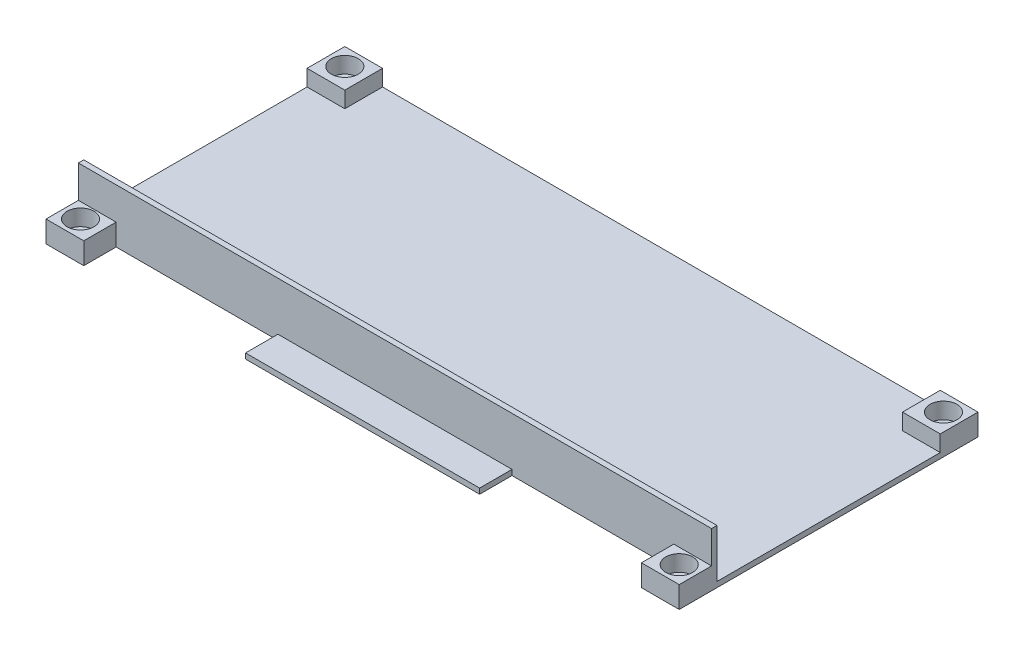
ISO-10303-21;
HEADER;
FILE_DESCRIPTION(('STEP AP214'),'2;1');
FILE_NAME('part.step','',(''),(''),'','','');
FILE_SCHEMA(('AUTOMOTIVE_DESIGN { 1 0 10303 214 1 1 1 1 }'));
ENDSEC;
DATA;
#1=APPLICATION_CONTEXT('core data for automotive mechanical design processes');
#2=APPLICATION_PROTOCOL_DEFINITION('international standard','automotive_design',2000,#1);
#3=PRODUCT_CONTEXT('',#1,'mechanical');
#4=PRODUCT('Part','Part','',(#3));
#5=PRODUCT_RELATED_PRODUCT_CATEGORY('part','',(#4));
#6=PRODUCT_DEFINITION_FORMATION('','',#4);
#7=PRODUCT_DEFINITION_CONTEXT('part definition',#1,'design');
#8=PRODUCT_DEFINITION('design','',#6,#7);
#9=PRODUCT_DEFINITION_SHAPE('','',#8);
#10=(LENGTH_UNIT() NAMED_UNIT(*) SI_UNIT(.MILLI.,.METRE.));
#11=(NAMED_UNIT(*) PLANE_ANGLE_UNIT() SI_UNIT($,.RADIAN.));
#12=(NAMED_UNIT(*) SI_UNIT($,.STERADIAN.) SOLID_ANGLE_UNIT());
#13=UNCERTAINTY_MEASURE_WITH_UNIT(LENGTH_MEASURE(1.E-05),#10,'distance_accuracy_value','');
#14=(GEOMETRIC_REPRESENTATION_CONTEXT(3) GLOBAL_UNCERTAINTY_ASSIGNED_CONTEXT((#13)) GLOBAL_UNIT_ASSIGNED_CONTEXT((#10,
#11,#12)) REPRESENTATION_CONTEXT('',''));
#15=CARTESIAN_POINT('',(0.,0.,0.));
#16=DIRECTION('',(0.,0.,1.));
#17=DIRECTION('',(1.,0.,0.));
#18=AXIS2_PLACEMENT_3D('',#15,#16,#17);
#19=CARTESIAN_POINT('',(0.,1.,0.));
#20=DIRECTION('',(0.,-1.,0.));
#21=DIRECTION('',(0.,0.,-1.));
#22=AXIS2_PLACEMENT_3D('',#19,#20,#21);
#23=PLANE('',#22);
#24=DIRECTION('',(0.,0.,1.));
#25=VECTOR('',#24,1.);
#26=CARTESIAN_POINT('',(-58.7,1.,27.7));
#27=LINE('',#26,#25);
#28=CARTESIAN_POINT('',(-58.7,1.,-20.7));
#29=VERTEX_POINT('',#28);
#30=CARTESIAN_POINT('',(-58.7,1.,20.7));
#31=VERTEX_POINT('',#30);
#32=EDGE_CURVE('E366',#29,#31,#27,.T.);
#33=ORIENTED_EDGE('',*,*,#32,.T.);
#34=DIRECTION('',(-1.,0.,0.));
#35=VECTOR('',#34,1.);
#36=CARTESIAN_POINT('',(58.7,1.,20.7));
#37=LINE('',#36,#35);
#38=CARTESIAN_POINT('',(58.7,1.,20.7));
#39=VERTEX_POINT('',#38);
#40=EDGE_CURVE('E306',#39,#31,#37,.T.);
#41=ORIENTED_EDGE('',*,*,#40,.F.);
#42=DIRECTION('',(0.,0.,-1.));
#43=VECTOR('',#42,1.);
#44=CARTESIAN_POINT('',(58.7,1.,27.7));
#45=LINE('',#44,#43);
#46=CARTESIAN_POINT('',(58.7,1.,-20.7));
#47=VERTEX_POINT('',#46);
#48=EDGE_CURVE('E192',#39,#47,#45,.T.);
#49=ORIENTED_EDGE('',*,*,#48,.T.);
#50=DIRECTION('',(1.,0.,0.));
#51=VECTOR('',#50,1.);
#52=CARTESIAN_POINT('',(58.7,1.,-20.7));
#53=LINE('',#52,#51);
#54=CARTESIAN_POINT('',(51.7,1.,-20.7));
#55=VERTEX_POINT('',#54);
#56=EDGE_CURVE('E318',#55,#47,#53,.T.);
#57=ORIENTED_EDGE('',*,*,#56,.F.);
#58=DIRECTION('',(0.,0.,1.));
#59=VECTOR('',#58,1.);
#60=CARTESIAN_POINT('',(51.7,1.,-27.7));
#61=LINE('',#60,#59);
#62=CARTESIAN_POINT('',(51.7,1.,-27.7));
#63=VERTEX_POINT('',#62);
#64=EDGE_CURVE('E194',#63,#55,#61,.T.);
#65=ORIENTED_EDGE('',*,*,#64,.F.);
#66=DIRECTION('',(-1.,0.,0.));
#67=VECTOR('',#66,1.);
#68=CARTESIAN_POINT('',(-58.7,1.,-27.7));
#69=LINE('',#68,#67);
#70=CARTESIAN_POINT('',(-51.7,1.,-27.7));
#71=VERTEX_POINT('',#70);
#72=EDGE_CURVE('E363',#63,#71,#69,.T.);
#73=ORIENTED_EDGE('',*,*,#72,.T.);
#74=DIRECTION('',(0.,0.,-1.));
#75=VECTOR('',#74,1.);
#76=CARTESIAN_POINT('',(-51.7,1.,-27.7));
#77=LINE('',#76,#75);
#78=CARTESIAN_POINT('',(-51.7,1.,-20.7));
#79=VERTEX_POINT('',#78);
#80=EDGE_CURVE('E341',#79,#71,#77,.T.);
#81=ORIENTED_EDGE('',*,*,#80,.F.);
#82=DIRECTION('',(1.,0.,0.));
#83=VECTOR('',#82,1.);
#84=CARTESIAN_POINT('',(-58.7,1.,-20.7));
#85=LINE('',#84,#83);
#86=EDGE_CURVE('E336',#29,#79,#85,.T.);
#87=ORIENTED_EDGE('',*,*,#86,.F.);
#88=EDGE_LOOP('',(#33,#41,#49,#57,#65,#73,#81,#87));
#89=FACE_BOUND('',#88,.T.);
#90=ADVANCED_FACE('F35',(#89),#23,.F.);
#91=DIRECTION('',(1.,0.,0.));
#92=VECTOR('',#91,1.);
#93=CARTESIAN_POINT('',(58.7,1.,21.7));
#94=LINE('',#93,#92);
#95=CARTESIAN_POINT('',(-21.7,1.,21.7));
#96=VERTEX_POINT('',#95);
#97=CARTESIAN_POINT('',(21.7,1.,21.7));
#98=VERTEX_POINT('',#97);
#99=EDGE_CURVE('E210',#96,#98,#94,.T.);
#100=ORIENTED_EDGE('',*,*,#99,.F.);
#101=DIRECTION('',(0.,0.,1.));
#102=VECTOR('',#101,1.);
#103=CARTESIAN_POINT('',(-21.7,1.,0.));
#104=LINE('',#103,#102);
#105=CARTESIAN_POINT('',(-21.7,1.,27.7));
#106=VERTEX_POINT('',#105);
#107=EDGE_CURVE('E260',#96,#106,#104,.T.);
#108=ORIENTED_EDGE('',*,*,#107,.T.);
#109=DIRECTION('',(1.,0.,0.));
#110=VECTOR('',#109,1.);
#111=CARTESIAN_POINT('',(-58.7,1.,27.7));
#112=LINE('',#111,#110);
#113=CARTESIAN_POINT('',(21.7,1.,27.7));
#114=VERTEX_POINT('',#113);
#115=EDGE_CURVE('E369',#106,#114,#112,.T.);
#116=ORIENTED_EDGE('',*,*,#115,.T.);
#117=DIRECTION('',(0.,0.,-1.));
#118=VECTOR('',#117,1.);
#119=CARTESIAN_POINT('',(21.7,1.,0.));
#120=LINE('',#119,#118);
#121=EDGE_CURVE('E281',#114,#98,#120,.T.);
#122=ORIENTED_EDGE('',*,*,#121,.T.);
#123=EDGE_LOOP('',(#100,#108,#116,#122));
#124=FACE_BOUND('',#123,.T.);
#125=ADVANCED_FACE('F423',(#124),#23,.F.);
#126=CARTESIAN_POINT('',(51.7,4.,27.7));
#127=DIRECTION('',(1.,0.,0.));
#128=DIRECTION('',(0.,0.,-1.));
#129=AXIS2_PLACEMENT_3D('',#126,#127,#128);
#130=PLANE('',#129);
#131=DIRECTION('',(0.,0.,1.));
#132=VECTOR('',#131,1.);
#133=CARTESIAN_POINT('',(51.7,4.,27.7));
#134=LINE('',#133,#132);
#135=CARTESIAN_POINT('',(51.7,4.,21.7));
#136=VERTEX_POINT('',#135);
#137=CARTESIAN_POINT('',(51.7,4.,27.7));
#138=VERTEX_POINT('',#137);
#139=EDGE_CURVE('E310',#136,#138,#134,.T.);
#140=ORIENTED_EDGE('',*,*,#139,.F.);
#141=DIRECTION('',(0.,-1.,0.));
#142=VECTOR('',#141,1.);
#143=CARTESIAN_POINT('',(51.7,4.,21.7));
#144=LINE('',#143,#142);
#145=CARTESIAN_POINT('',(51.7,0.,21.7));
#146=VERTEX_POINT('',#145);
#147=EDGE_CURVE('E50',#136,#146,#144,.T.);
#148=ORIENTED_EDGE('',*,*,#147,.T.);
#149=DIRECTION('',(0.,0.,1.));
#150=VECTOR('',#149,1.);
#151=CARTESIAN_POINT('',(51.7,0.,27.7));
#152=LINE('',#151,#150);
#153=CARTESIAN_POINT('',(51.7,0.,27.7));
#154=VERTEX_POINT('',#153);
#155=EDGE_CURVE('E249',#146,#154,#152,.T.);
#156=ORIENTED_EDGE('',*,*,#155,.T.);
#157=DIRECTION('',(0.,-1.,0.));
#158=VECTOR('',#157,1.);
#159=CARTESIAN_POINT('',(51.7,4.,27.7));
#160=LINE('',#159,#158);
#161=EDGE_CURVE('E195',#138,#154,#160,.T.);
#162=ORIENTED_EDGE('',*,*,#161,.F.);
#163=EDGE_LOOP('',(#140,#148,#156,#162));
#164=FACE_BOUND('',#163,.T.);
#165=ADVANCED_FACE('F429',(#164),#130,.F.);
#166=CARTESIAN_POINT('',(0.,4.,0.));
#167=DIRECTION('',(0.,-1.,0.));
#168=DIRECTION('',(0.,0.,-1.));
#169=AXIS2_PLACEMENT_3D('',#166,#167,#168);
#170=PLANE('',#169);
#171=CARTESIAN_POINT('',(55.5,4.,24.5));
#172=DIRECTION('',(0.,1.,0.));
#173=DIRECTION('',(0.,0.,1.));
#174=AXIS2_PLACEMENT_3D('',#171,#172,#173);
#175=CIRCLE('',#174,2.5);
#176=CARTESIAN_POINT('',(55.5,4.,27.));
#177=VERTEX_POINT('',#176);
#178=EDGE_CURVE('E233',#177,#177,#175,.T.);
#179=ORIENTED_EDGE('',*,*,#178,.F.);
#180=EDGE_LOOP('',(#179));
#181=FACE_BOUND('',#180,.T.);
#182=DIRECTION('',(1.,0.,0.));
#183=VECTOR('',#182,1.);
#184=CARTESIAN_POINT('',(0.,4.,21.7));
#185=LINE('',#184,#183);
#186=CARTESIAN_POINT('',(58.7,4.,21.7));
#187=VERTEX_POINT('',#186);
#188=EDGE_CURVE('E222',#136,#187,#185,.T.);
#189=ORIENTED_EDGE('',*,*,#188,.F.);
#190=ORIENTED_EDGE('',*,*,#139,.T.);
#191=DIRECTION('',(1.,0.,0.));
#192=VECTOR('',#191,1.);
#193=CARTESIAN_POINT('',(58.7,4.,27.7));
#194=LINE('',#193,#192);
#195=CARTESIAN_POINT('',(58.7,4.,27.7));
#196=VERTEX_POINT('',#195);
#197=EDGE_CURVE('E307',#138,#196,#194,.T.);
#198=ORIENTED_EDGE('',*,*,#197,.T.);
#199=DIRECTION('',(0.,0.,-1.));
#200=VECTOR('',#199,1.);
#201=CARTESIAN_POINT('',(58.7,4.,27.7));
#202=LINE('',#201,#200);
#203=EDGE_CURVE('E57',#196,#187,#202,.T.);
#204=ORIENTED_EDGE('',*,*,#203,.T.);
#205=EDGE_LOOP('',(#189,#190,#198,#204));
#206=FACE_BOUND('',#205,.T.);
#207=ADVANCED_FACE('F474',(#181,#206),#170,.F.);
#208=CARTESIAN_POINT('',(-51.7,4.,27.7));
#209=DIRECTION('',(-1.,0.,0.));
#210=DIRECTION('',(0.,0.,1.));
#211=AXIS2_PLACEMENT_3D('',#208,#209,#210);
#212=PLANE('',#211);
#213=DIRECTION('',(0.,-1.,0.));
#214=VECTOR('',#213,1.);
#215=CARTESIAN_POINT('',(-51.7,4.,21.7));
#216=LINE('',#215,#214);
#217=CARTESIAN_POINT('',(-51.7,4.,21.7));
#218=VERTEX_POINT('',#217);
#219=CARTESIAN_POINT('',(-51.7,0.,21.7));
#220=VERTEX_POINT('',#219);
#221=EDGE_CURVE('E273',#218,#220,#216,.T.);
#222=ORIENTED_EDGE('',*,*,#221,.F.);
#223=DIRECTION('',(0.,0.,-1.));
#224=VECTOR('',#223,1.);
#225=CARTESIAN_POINT('',(-51.7,4.,27.7));
#226=LINE('',#225,#224);
#227=CARTESIAN_POINT('',(-51.7,4.,27.7));
#228=VERTEX_POINT('',#227);
#229=EDGE_CURVE('E300',#228,#218,#226,.T.);
#230=ORIENTED_EDGE('',*,*,#229,.F.);
#231=DIRECTION('',(0.,-1.,0.));
#232=VECTOR('',#231,1.);
#233=CARTESIAN_POINT('',(-51.7,4.,27.7));
#234=LINE('',#233,#232);
#235=CARTESIAN_POINT('',(-51.7,0.,27.7));
#236=VERTEX_POINT('',#235);
#237=EDGE_CURVE('E304',#228,#236,#234,.T.);
#238=ORIENTED_EDGE('',*,*,#237,.T.);
#239=DIRECTION('',(0.,0.,-1.));
#240=VECTOR('',#239,1.);
#241=CARTESIAN_POINT('',(-51.7,0.,27.7));
#242=LINE('',#241,#240);
#243=EDGE_CURVE('E264',#236,#220,#242,.T.);
#244=ORIENTED_EDGE('',*,*,#243,.T.);
#245=EDGE_LOOP('',(#222,#230,#238,#244));
#246=FACE_BOUND('',#245,.T.);
#247=ADVANCED_FACE('F518',(#246),#212,.F.);
#248=CARTESIAN_POINT('',(0.,4.,0.));
#249=DIRECTION('',(0.,-1.,0.));
#250=DIRECTION('',(0.,0.,-1.));
#251=AXIS2_PLACEMENT_3D('',#248,#249,#250);
#252=PLANE('',#251);
#253=CARTESIAN_POINT('',(-55.5,4.,24.5));
#254=DIRECTION('',(0.,1.,0.));
#255=DIRECTION('',(0.,0.,1.));
#256=AXIS2_PLACEMENT_3D('',#253,#254,#255);
#257=CIRCLE('',#256,2.5);
#258=CARTESIAN_POINT('',(-55.5,4.,27.));
#259=VERTEX_POINT('',#258);
#260=EDGE_CURVE('E224',#259,#259,#257,.T.);
#261=ORIENTED_EDGE('',*,*,#260,.F.);
#262=EDGE_LOOP('',(#261));
#263=FACE_BOUND('',#262,.T.);
#264=DIRECTION('',(1.,0.,0.));
#265=VECTOR('',#264,1.);
#266=CARTESIAN_POINT('',(0.,4.,21.7));
#267=LINE('',#266,#265);
#268=CARTESIAN_POINT('',(-58.7,4.,21.7));
#269=VERTEX_POINT('',#268);
#270=EDGE_CURVE('E12',#269,#218,#267,.T.);
#271=ORIENTED_EDGE('',*,*,#270,.F.);
#272=DIRECTION('',(0.,0.,1.));
#273=VECTOR('',#272,1.);
#274=CARTESIAN_POINT('',(-58.7,4.,27.7));
#275=LINE('',#274,#273);
#276=CARTESIAN_POINT('',(-58.7,4.,27.7));
#277=VERTEX_POINT('',#276);
#278=EDGE_CURVE('E296',#269,#277,#275,.T.);
#279=ORIENTED_EDGE('',*,*,#278,.T.);
#280=DIRECTION('',(1.,0.,0.));
#281=VECTOR('',#280,1.);
#282=CARTESIAN_POINT('',(-58.7,4.,27.7));
#283=LINE('',#282,#281);
#284=EDGE_CURVE('E298',#277,#228,#283,.T.);
#285=ORIENTED_EDGE('',*,*,#284,.T.);
#286=ORIENTED_EDGE('',*,*,#229,.T.);
#287=EDGE_LOOP('',(#271,#279,#285,#286));
#288=FACE_BOUND('',#287,.T.);
#289=ADVANCED_FACE('F515',(#263,#288),#252,.F.);
#290=CARTESIAN_POINT('',(-58.7,1.,27.7));
#291=DIRECTION('',(0.,0.,-1.));
#292=DIRECTION('',(-1.,0.,0.));
#293=AXIS2_PLACEMENT_3D('',#290,#291,#292);
#294=PLANE('',#293);
#295=ORIENTED_EDGE('',*,*,#161,.T.);
#296=DIRECTION('',(1.,0.,0.));
#297=VECTOR('',#296,1.);
#298=CARTESIAN_POINT('',(-58.7,0.,27.7));
#299=LINE('',#298,#297);
#300=CARTESIAN_POINT('',(58.7,0.,27.7));
#301=VERTEX_POINT('',#300);
#302=EDGE_CURVE('E379',#154,#301,#299,.T.);
#303=ORIENTED_EDGE('',*,*,#302,.T.);
#304=DIRECTION('',(0.,-1.,0.));
#305=VECTOR('',#304,1.);
#306=CARTESIAN_POINT('',(58.7,1.,27.7));
#307=LINE('',#306,#305);
#308=EDGE_CURVE('E372',#196,#301,#307,.T.);
#309=ORIENTED_EDGE('',*,*,#308,.F.);
#310=ORIENTED_EDGE('',*,*,#197,.F.);
#311=EDGE_LOOP('',(#295,#303,#309,#310));
#312=FACE_BOUND('',#311,.T.);
#313=ADVANCED_FACE('F444',(#312),#294,.F.);
#314=CARTESIAN_POINT('',(-21.7,0.,27.7));
#315=VERTEX_POINT('',#314);
#316=CARTESIAN_POINT('',(21.7,0.,27.7));
#317=VERTEX_POINT('',#316);
#318=EDGE_CURVE('E382',#315,#317,#299,.T.);
#319=ORIENTED_EDGE('',*,*,#318,.T.);
#320=DIRECTION('',(0.,-1.,0.));
#321=VECTOR('',#320,1.);
#322=CARTESIAN_POINT('',(21.7,4.,27.7));
#323=LINE('',#322,#321);
#324=EDGE_CURVE('E258',#114,#317,#323,.T.);
#325=ORIENTED_EDGE('',*,*,#324,.F.);
#326=ORIENTED_EDGE('',*,*,#115,.F.);
#327=DIRECTION('',(0.,-1.,0.));
#328=VECTOR('',#327,1.);
#329=CARTESIAN_POINT('',(-21.7,4.,27.7));
#330=LINE('',#329,#328);
#331=EDGE_CURVE('E253',#106,#315,#330,.T.);
#332=ORIENTED_EDGE('',*,*,#331,.T.);
#333=EDGE_LOOP('',(#319,#325,#326,#332));
#334=FACE_BOUND('',#333,.T.);
#335=ADVANCED_FACE('F445',(#334),#294,.F.);
#336=CARTESIAN_POINT('',(58.7,1.,27.7));
#337=DIRECTION('',(-1.,0.,0.));
#338=DIRECTION('',(0.,0.,1.));
#339=AXIS2_PLACEMENT_3D('',#336,#337,#338);
#340=PLANE('',#339);
#341=DIRECTION('',(0.,-1.,0.));
#342=VECTOR('',#341,1.);
#343=CARTESIAN_POINT('',(58.7,4.,20.7));
#344=LINE('',#343,#342);
#345=CARTESIAN_POINT('',(58.7,10.,20.7));
#346=VERTEX_POINT('',#345);
#347=EDGE_CURVE('E186',#346,#39,#344,.T.);
#348=ORIENTED_EDGE('',*,*,#347,.F.);
#349=DIRECTION('',(0.,0.,-1.));
#350=VECTOR('',#349,1.);
#351=CARTESIAN_POINT('',(58.7,10.,21.7));
#352=LINE('',#351,#350);
#353=CARTESIAN_POINT('',(58.7,10.,21.7));
#354=VERTEX_POINT('',#353);
#355=EDGE_CURVE('E190',#354,#346,#352,.T.);
#356=ORIENTED_EDGE('',*,*,#355,.F.);
#357=DIRECTION('',(0.,-1.,0.));
#358=VECTOR('',#357,1.);
#359=CARTESIAN_POINT('',(58.7,10.,21.7));
#360=LINE('',#359,#358);
#361=EDGE_CURVE('E216',#354,#187,#360,.T.);
#362=ORIENTED_EDGE('',*,*,#361,.T.);
#363=ORIENTED_EDGE('',*,*,#203,.F.);
#364=ORIENTED_EDGE('',*,*,#308,.T.);
#365=DIRECTION('',(0.,0.,-1.));
#366=VECTOR('',#365,1.);
#367=CARTESIAN_POINT('',(58.7,0.,27.7));
#368=LINE('',#367,#366);
#369=CARTESIAN_POINT('',(58.7,0.,-27.7));
#370=VERTEX_POINT('',#369);
#371=EDGE_CURVE('E361',#301,#370,#368,.T.);
#372=ORIENTED_EDGE('',*,*,#371,.T.);
#373=DIRECTION('',(0.,-1.,0.));
#374=VECTOR('',#373,1.);
#375=CARTESIAN_POINT('',(58.7,1.,-27.7));
#376=LINE('',#375,#374);
#377=CARTESIAN_POINT('',(58.7,4.,-27.7));
#378=VERTEX_POINT('',#377);
#379=EDGE_CURVE('E43',#378,#370,#376,.T.);
#380=ORIENTED_EDGE('',*,*,#379,.F.);
#381=DIRECTION('',(0.,0.,-1.));
#382=VECTOR('',#381,1.);
#383=CARTESIAN_POINT('',(58.7,4.,-27.7));
#384=LINE('',#383,#382);
#385=CARTESIAN_POINT('',(58.7,4.,-20.7));
#386=VERTEX_POINT('',#385);
#387=EDGE_CURVE('E314',#386,#378,#384,.T.);
#388=ORIENTED_EDGE('',*,*,#387,.F.);
#389=DIRECTION('',(0.,-1.,0.));
#390=VECTOR('',#389,1.);
#391=CARTESIAN_POINT('',(58.7,4.,-20.7));
#392=LINE('',#391,#390);
#393=EDGE_CURVE('E324',#386,#47,#392,.T.);
#394=ORIENTED_EDGE('',*,*,#393,.T.);
#395=ORIENTED_EDGE('',*,*,#48,.F.);
#396=EDGE_LOOP('',(#348,#356,#362,#363,#364,#372,#380,#388,#394,#395));
#397=FACE_BOUND('',#396,.T.);
#398=ADVANCED_FACE('F37',(#397),#340,.F.);
#399=CARTESIAN_POINT('',(-58.7,1.,-27.7));
#400=DIRECTION('',(0.,0.,1.));
#401=DIRECTION('',(1.,0.,0.));
#402=AXIS2_PLACEMENT_3D('',#399,#400,#401);
#403=PLANE('',#402);
#404=DIRECTION('',(-1.,0.,0.));
#405=VECTOR('',#404,1.);
#406=CARTESIAN_POINT('',(-58.7,0.,-27.7));
#407=LINE('',#406,#405);
#408=CARTESIAN_POINT('',(-58.7,0.,-27.7));
#409=VERTEX_POINT('',#408);
#410=EDGE_CURVE('E375',#370,#409,#407,.T.);
#411=ORIENTED_EDGE('',*,*,#410,.T.);
#412=DIRECTION('',(0.,-1.,0.));
#413=VECTOR('',#412,1.);
#414=CARTESIAN_POINT('',(-58.7,1.,-27.7));
#415=LINE('',#414,#413);
#416=CARTESIAN_POINT('',(-58.7,4.,-27.7));
#417=VERTEX_POINT('',#416);
#418=EDGE_CURVE('E388',#417,#409,#415,.T.);
#419=ORIENTED_EDGE('',*,*,#418,.F.);
#420=DIRECTION('',(-1.,0.,0.));
#421=VECTOR('',#420,1.);
#422=CARTESIAN_POINT('',(-58.7,4.,-27.7));
#423=LINE('',#422,#421);
#424=CARTESIAN_POINT('',(-51.7,4.,-27.7));
#425=VERTEX_POINT('',#424);
#426=EDGE_CURVE('E345',#425,#417,#423,.T.);
#427=ORIENTED_EDGE('',*,*,#426,.F.);
#428=DIRECTION('',(0.,-1.,0.));
#429=VECTOR('',#428,1.);
#430=CARTESIAN_POINT('',(-51.7,4.,-27.7));
#431=LINE('',#430,#429);
#432=EDGE_CURVE('E348',#425,#71,#431,.T.);
#433=ORIENTED_EDGE('',*,*,#432,.T.);
#434=ORIENTED_EDGE('',*,*,#72,.F.);
#435=DIRECTION('',(0.,-1.,0.));
#436=VECTOR('',#435,1.);
#437=CARTESIAN_POINT('',(51.7,4.,-27.7));
#438=LINE('',#437,#436);
#439=CARTESIAN_POINT('',(51.7,4.,-27.7));
#440=VERTEX_POINT('',#439);
#441=EDGE_CURVE('E333',#440,#63,#438,.T.);
#442=ORIENTED_EDGE('',*,*,#441,.F.);
#443=DIRECTION('',(-1.,0.,0.));
#444=VECTOR('',#443,1.);
#445=CARTESIAN_POINT('',(58.7,4.,-27.7));
#446=LINE('',#445,#444);
#447=EDGE_CURVE('E317',#378,#440,#446,.T.);
#448=ORIENTED_EDGE('',*,*,#447,.F.);
#449=ORIENTED_EDGE('',*,*,#379,.T.);
#450=EDGE_LOOP('',(#411,#419,#427,#433,#434,#442,#448,#449));
#451=FACE_BOUND('',#450,.T.);
#452=ADVANCED_FACE('F447',(#451),#403,.F.);
#453=CARTESIAN_POINT('',(-58.7,1.,27.7));
#454=DIRECTION('',(1.,0.,0.));
#455=DIRECTION('',(0.,0.,-1.));
#456=AXIS2_PLACEMENT_3D('',#453,#454,#455);
#457=PLANE('',#456);
#458=ORIENTED_EDGE('',*,*,#278,.F.);
#459=DIRECTION('',(0.,-1.,0.));
#460=VECTOR('',#459,1.);
#461=CARTESIAN_POINT('',(-58.7,10.,21.7));
#462=LINE('',#461,#460);
#463=CARTESIAN_POINT('',(-58.7,10.,21.7));
#464=VERTEX_POINT('',#463);
#465=EDGE_CURVE('E219',#464,#269,#462,.T.);
#466=ORIENTED_EDGE('',*,*,#465,.F.);
#467=DIRECTION('',(0.,0.,1.));
#468=VECTOR('',#467,1.);
#469=CARTESIAN_POINT('',(-58.7,10.,21.7));
#470=LINE('',#469,#468);
#471=CARTESIAN_POINT('',(-58.7,10.,20.7));
#472=VERTEX_POINT('',#471);
#473=EDGE_CURVE('E204',#472,#464,#470,.T.);
#474=ORIENTED_EDGE('',*,*,#473,.F.);
#475=DIRECTION('',(0.,-1.,0.));
#476=VECTOR('',#475,1.);
#477=CARTESIAN_POINT('',(-58.7,4.,20.7));
#478=LINE('',#477,#476);
#479=EDGE_CURVE('E201',#472,#31,#478,.T.);
#480=ORIENTED_EDGE('',*,*,#479,.T.);
#481=ORIENTED_EDGE('',*,*,#32,.F.);
#482=DIRECTION('',(0.,-1.,0.));
#483=VECTOR('',#482,1.);
#484=CARTESIAN_POINT('',(-58.7,4.,-20.7));
#485=LINE('',#484,#483);
#486=CARTESIAN_POINT('',(-58.7,4.,-20.7));
#487=VERTEX_POINT('',#486);
#488=EDGE_CURVE('E358',#487,#29,#485,.T.);
#489=ORIENTED_EDGE('',*,*,#488,.F.);
#490=DIRECTION('',(0.,0.,1.));
#491=VECTOR('',#490,1.);
#492=CARTESIAN_POINT('',(-58.7,4.,-27.7));
#493=LINE('',#492,#491);
#494=EDGE_CURVE('E337',#417,#487,#493,.T.);
#495=ORIENTED_EDGE('',*,*,#494,.F.);
#496=ORIENTED_EDGE('',*,*,#418,.T.);
#497=DIRECTION('',(0.,0.,1.));
#498=VECTOR('',#497,1.);
#499=CARTESIAN_POINT('',(-58.7,0.,27.7));
#500=LINE('',#499,#498);
#501=CARTESIAN_POINT('',(-58.7,0.,27.7));
#502=VERTEX_POINT('',#501);
#503=EDGE_CURVE('E377',#409,#502,#500,.T.);
#504=ORIENTED_EDGE('',*,*,#503,.T.);
#505=DIRECTION('',(0.,-1.,0.));
#506=VECTOR('',#505,1.);
#507=CARTESIAN_POINT('',(-58.7,1.,27.7));
#508=LINE('',#507,#506);
#509=EDGE_CURVE('E385',#277,#502,#508,.T.);
#510=ORIENTED_EDGE('',*,*,#509,.F.);
#511=EDGE_LOOP('',(#458,#466,#474,#480,#481,#489,#495,#496,#504,#510));
#512=FACE_BOUND('',#511,.T.);
#513=ADVANCED_FACE('F442',(#512),#457,.F.);
#514=EDGE_CURVE('E364',#502,#236,#299,.T.);
#515=ORIENTED_EDGE('',*,*,#514,.T.);
#516=ORIENTED_EDGE('',*,*,#237,.F.);
#517=ORIENTED_EDGE('',*,*,#284,.F.);
#518=ORIENTED_EDGE('',*,*,#509,.T.);
#519=EDGE_LOOP('',(#515,#516,#517,#518));
#520=FACE_BOUND('',#519,.T.);
#521=ADVANCED_FACE('F438',(#520),#294,.F.);
#522=CARTESIAN_POINT('',(0.,0.,0.));
#523=DIRECTION('',(0.,-1.,0.));
#524=DIRECTION('',(0.,0.,-1.));
#525=AXIS2_PLACEMENT_3D('',#522,#523,#524);
#526=PLANE('',#525);
#527=ORIENTED_EDGE('',*,*,#155,.F.);
#528=DIRECTION('',(1.,0.,0.));
#529=VECTOR('',#528,1.);
#530=CARTESIAN_POINT('',(51.7,0.,21.7));
#531=LINE('',#530,#529);
#532=CARTESIAN_POINT('',(21.7,0.,21.7));
#533=VERTEX_POINT('',#532);
#534=EDGE_CURVE('E256',#533,#146,#531,.T.);
#535=ORIENTED_EDGE('',*,*,#534,.F.);
#536=DIRECTION('',(0.,0.,-1.));
#537=VECTOR('',#536,1.);
#538=CARTESIAN_POINT('',(21.7,0.,27.7));
#539=LINE('',#538,#537);
#540=EDGE_CURVE('E252',#317,#533,#539,.T.);
#541=ORIENTED_EDGE('',*,*,#540,.F.);
#542=ORIENTED_EDGE('',*,*,#318,.F.);
#543=DIRECTION('',(0.,0.,1.));
#544=VECTOR('',#543,1.);
#545=CARTESIAN_POINT('',(-21.7,0.,27.7));
#546=LINE('',#545,#544);
#547=CARTESIAN_POINT('',(-21.7,0.,21.7));
#548=VERTEX_POINT('',#547);
#549=EDGE_CURVE('E271',#548,#315,#546,.T.);
#550=ORIENTED_EDGE('',*,*,#549,.F.);
#551=DIRECTION('',(1.,0.,0.));
#552=VECTOR('',#551,1.);
#553=CARTESIAN_POINT('',(-51.7,0.,21.7));
#554=LINE('',#553,#552);
#555=EDGE_CURVE('E267',#220,#548,#554,.T.);
#556=ORIENTED_EDGE('',*,*,#555,.F.);
#557=ORIENTED_EDGE('',*,*,#243,.F.);
#558=ORIENTED_EDGE('',*,*,#514,.F.);
#559=ORIENTED_EDGE('',*,*,#503,.F.);
#560=ORIENTED_EDGE('',*,*,#410,.F.);
#561=ORIENTED_EDGE('',*,*,#371,.F.);
#562=ORIENTED_EDGE('',*,*,#302,.F.);
#563=EDGE_LOOP('',(#527,#535,#541,#542,#550,#556,#557,#558,#559,#560,#561,#562));
#564=FACE_BOUND('',#563,.T.);
#565=CARTESIAN_POINT('',(-55.5,0.,24.5));
#566=DIRECTION('',(0.,1.,0.));
#567=DIRECTION('',(0.,0.,1.));
#568=AXIS2_PLACEMENT_3D('',#565,#566,#567);
#569=CIRCLE('',#568,1.35);
#570=CARTESIAN_POINT('',(-55.5,0.,25.85));
#571=VERTEX_POINT('',#570);
#572=EDGE_CURVE('E284',#571,#571,#569,.T.);
#573=ORIENTED_EDGE('',*,*,#572,.T.);
#574=EDGE_LOOP('',(#573));
#575=FACE_BOUND('',#574,.T.);
#576=CARTESIAN_POINT('',(55.5,0.,24.5));
#577=DIRECTION('',(0.,1.,0.));
#578=DIRECTION('',(0.,0.,1.));
#579=AXIS2_PLACEMENT_3D('',#576,#577,#578);
#580=CIRCLE('',#579,1.35);
#581=CARTESIAN_POINT('',(55.5,0.,25.85));
#582=VERTEX_POINT('',#581);
#583=EDGE_CURVE('E289',#582,#582,#580,.T.);
#584=ORIENTED_EDGE('',*,*,#583,.T.);
#585=EDGE_LOOP('',(#584));
#586=FACE_BOUND('',#585,.T.);
#587=CARTESIAN_POINT('',(55.5,0.,-24.5));
#588=DIRECTION('',(0.,1.,0.));
#589=DIRECTION('',(0.,0.,1.));
#590=AXIS2_PLACEMENT_3D('',#587,#588,#589);
#591=CIRCLE('',#590,1.35);
#592=CARTESIAN_POINT('',(55.5,0.,-23.15));
#593=VERTEX_POINT('',#592);
#594=EDGE_CURVE('E285',#593,#593,#591,.T.);
#595=ORIENTED_EDGE('',*,*,#594,.T.);
#596=EDGE_LOOP('',(#595));
#597=FACE_BOUND('',#596,.T.);
#598=CARTESIAN_POINT('',(-55.5,0.,-24.5));
#599=DIRECTION('',(0.,1.,0.));
#600=DIRECTION('',(0.,0.,1.));
#601=AXIS2_PLACEMENT_3D('',#598,#599,#600);
#602=CIRCLE('',#601,1.35);
#603=CARTESIAN_POINT('',(-55.5,0.,-23.15));
#604=VERTEX_POINT('',#603);
#605=EDGE_CURVE('E288',#604,#604,#602,.T.);
#606=ORIENTED_EDGE('',*,*,#605,.T.);
#607=EDGE_LOOP('',(#606));
#608=FACE_BOUND('',#607,.T.);
#609=ADVANCED_FACE('F435',(#564,#575,#586,#597,#608),#526,.T.);
#610=CARTESIAN_POINT('',(-58.7,4.,-20.7));
#611=DIRECTION('',(0.,0.,-1.));
#612=DIRECTION('',(-1.,0.,0.));
#613=AXIS2_PLACEMENT_3D('',#610,#611,#612);
#614=PLANE('',#613);
#615=ORIENTED_EDGE('',*,*,#86,.T.);
#616=DIRECTION('',(0.,-1.,0.));
#617=VECTOR('',#616,1.);
#618=CARTESIAN_POINT('',(-51.7,4.,-20.7));
#619=LINE('',#618,#617);
#620=CARTESIAN_POINT('',(-51.7,4.,-20.7));
#621=VERTEX_POINT('',#620);
#622=EDGE_CURVE('E355',#621,#79,#619,.T.);
#623=ORIENTED_EDGE('',*,*,#622,.F.);
#624=DIRECTION('',(1.,0.,0.));
#625=VECTOR('',#624,1.);
#626=CARTESIAN_POINT('',(-58.7,4.,-20.7));
#627=LINE('',#626,#625);
#628=EDGE_CURVE('E340',#487,#621,#627,.T.);
#629=ORIENTED_EDGE('',*,*,#628,.F.);
#630=ORIENTED_EDGE('',*,*,#488,.T.);
#631=EDGE_LOOP('',(#615,#623,#629,#630));
#632=FACE_BOUND('',#631,.T.);
#633=ADVANCED_FACE('F433',(#632),#614,.F.);
#634=CARTESIAN_POINT('',(-51.7,4.,-27.7));
#635=DIRECTION('',(-1.,0.,0.));
#636=DIRECTION('',(0.,0.,1.));
#637=AXIS2_PLACEMENT_3D('',#634,#635,#636);
#638=PLANE('',#637);
#639=ORIENTED_EDGE('',*,*,#80,.T.);
#640=ORIENTED_EDGE('',*,*,#432,.F.);
#641=DIRECTION('',(0.,0.,-1.));
#642=VECTOR('',#641,1.);
#643=CARTESIAN_POINT('',(-51.7,4.,-27.7));
#644=LINE('',#643,#642);
#645=EDGE_CURVE('E343',#621,#425,#644,.T.);
#646=ORIENTED_EDGE('',*,*,#645,.F.);
#647=ORIENTED_EDGE('',*,*,#622,.T.);
#648=EDGE_LOOP('',(#639,#640,#646,#647));
#649=FACE_BOUND('',#648,.T.);
#650=ADVANCED_FACE('F545',(#649),#638,.F.);
#651=CARTESIAN_POINT('',(0.,4.,0.));
#652=DIRECTION('',(0.,1.,0.));
#653=DIRECTION('',(0.,0.,1.));
#654=AXIS2_PLACEMENT_3D('',#651,#652,#653);
#655=PLANE('',#654);
#656=CARTESIAN_POINT('',(-55.5,4.,-24.5));
#657=DIRECTION('',(0.,1.,0.));
#658=DIRECTION('',(0.,0.,1.));
#659=AXIS2_PLACEMENT_3D('',#656,#657,#658);
#660=CIRCLE('',#659,2.5);
#661=CARTESIAN_POINT('',(-55.5,4.,-22.));
#662=VERTEX_POINT('',#661);
#663=EDGE_CURVE('E232',#662,#662,#660,.T.);
#664=ORIENTED_EDGE('',*,*,#663,.F.);
#665=EDGE_LOOP('',(#664));
#666=FACE_BOUND('',#665,.T.);
#667=ORIENTED_EDGE('',*,*,#494,.T.);
#668=ORIENTED_EDGE('',*,*,#628,.T.);
#669=ORIENTED_EDGE('',*,*,#645,.T.);
#670=ORIENTED_EDGE('',*,*,#426,.T.);
#671=EDGE_LOOP('',(#667,#668,#669,#670));
#672=FACE_BOUND('',#671,.T.);
#673=ADVANCED_FACE('F542',(#666,#672),#655,.T.);
#674=CARTESIAN_POINT('',(51.7,4.,-27.7));
#675=DIRECTION('',(1.,0.,0.));
#676=DIRECTION('',(0.,0.,-1.));
#677=AXIS2_PLACEMENT_3D('',#674,#675,#676);
#678=PLANE('',#677);
#679=ORIENTED_EDGE('',*,*,#64,.T.);
#680=DIRECTION('',(0.,-1.,0.));
#681=VECTOR('',#680,1.);
#682=CARTESIAN_POINT('',(51.7,4.,-20.7));
#683=LINE('',#682,#681);
#684=CARTESIAN_POINT('',(51.7,4.,-20.7));
#685=VERTEX_POINT('',#684);
#686=EDGE_CURVE('E330',#685,#55,#683,.T.);
#687=ORIENTED_EDGE('',*,*,#686,.F.);
#688=DIRECTION('',(0.,0.,1.));
#689=VECTOR('',#688,1.);
#690=CARTESIAN_POINT('',(51.7,4.,-27.7));
#691=LINE('',#690,#689);
#692=EDGE_CURVE('E320',#440,#685,#691,.T.);
#693=ORIENTED_EDGE('',*,*,#692,.F.);
#694=ORIENTED_EDGE('',*,*,#441,.T.);
#695=EDGE_LOOP('',(#679,#687,#693,#694));
#696=FACE_BOUND('',#695,.T.);
#697=ADVANCED_FACE('F538',(#696),#678,.F.);
#698=CARTESIAN_POINT('',(58.7,4.,-20.7));
#699=DIRECTION('',(0.,0.,-1.));
#700=DIRECTION('',(-1.,0.,0.));
#701=AXIS2_PLACEMENT_3D('',#698,#699,#700);
#702=PLANE('',#701);
#703=ORIENTED_EDGE('',*,*,#56,.T.);
#704=ORIENTED_EDGE('',*,*,#393,.F.);
#705=DIRECTION('',(1.,0.,0.));
#706=VECTOR('',#705,1.);
#707=CARTESIAN_POINT('',(58.7,4.,-20.7));
#708=LINE('',#707,#706);
#709=EDGE_CURVE('E322',#685,#386,#708,.T.);
#710=ORIENTED_EDGE('',*,*,#709,.F.);
#711=ORIENTED_EDGE('',*,*,#686,.T.);
#712=EDGE_LOOP('',(#703,#704,#710,#711));
#713=FACE_BOUND('',#712,.T.);
#714=ADVANCED_FACE('F534',(#713),#702,.F.);
#715=CARTESIAN_POINT('',(0.,4.,0.));
#716=DIRECTION('',(0.,-1.,0.));
#717=DIRECTION('',(0.,0.,-1.));
#718=AXIS2_PLACEMENT_3D('',#715,#716,#717);
#719=PLANE('',#718);
#720=CARTESIAN_POINT('',(55.5,4.,-24.5));
#721=DIRECTION('',(0.,1.,0.));
#722=DIRECTION('',(0.,0.,1.));
#723=AXIS2_PLACEMENT_3D('',#720,#721,#722);
#724=CIRCLE('',#723,2.5);
#725=CARTESIAN_POINT('',(55.5,4.,-22.));
#726=VERTEX_POINT('',#725);
#727=EDGE_CURVE('E225',#726,#726,#724,.T.);
#728=ORIENTED_EDGE('',*,*,#727,.F.);
#729=EDGE_LOOP('',(#728));
#730=FACE_BOUND('',#729,.T.);
#731=ORIENTED_EDGE('',*,*,#387,.T.);
#732=ORIENTED_EDGE('',*,*,#447,.T.);
#733=ORIENTED_EDGE('',*,*,#692,.T.);
#734=ORIENTED_EDGE('',*,*,#709,.T.);
#735=EDGE_LOOP('',(#731,#732,#733,#734));
#736=FACE_BOUND('',#735,.T.);
#737=ADVANCED_FACE('F531',(#730,#736),#719,.F.);
#738=CARTESIAN_POINT('',(58.7,4.,20.7));
#739=DIRECTION('',(0.,0.,1.));
#740=DIRECTION('',(1.,0.,0.));
#741=AXIS2_PLACEMENT_3D('',#738,#739,#740);
#742=PLANE('',#741);
#743=ORIENTED_EDGE('',*,*,#40,.T.);
#744=ORIENTED_EDGE('',*,*,#479,.F.);
#745=DIRECTION('',(-1.,0.,0.));
#746=VECTOR('',#745,1.);
#747=CARTESIAN_POINT('',(58.7,10.,20.7));
#748=LINE('',#747,#746);
#749=EDGE_CURVE('E198',#346,#472,#748,.T.);
#750=ORIENTED_EDGE('',*,*,#749,.F.);
#751=ORIENTED_EDGE('',*,*,#347,.T.);
#752=EDGE_LOOP('',(#743,#744,#750,#751));
#753=FACE_BOUND('',#752,.T.);
#754=ADVANCED_FACE('F199',(#753),#742,.F.);
#755=CARTESIAN_POINT('',(-55.5,0.,24.5));
#756=DIRECTION('',(0.,1.,0.));
#757=DIRECTION('',(0.,0.,1.));
#758=AXIS2_PLACEMENT_3D('',#755,#756,#757);
#759=CYLINDRICAL_SURFACE('',#758,1.35);
#760=CARTESIAN_POINT('',(-55.5,1.,24.5));
#761=DIRECTION('',(0.,-1.,0.));
#762=DIRECTION('',(0.,0.,-1.));
#763=AXIS2_PLACEMENT_3D('',#760,#761,#762);
#764=CIRCLE('',#763,1.35);
#765=CARTESIAN_POINT('',(-55.5,1.,23.15));
#766=VERTEX_POINT('',#765);
#767=EDGE_CURVE('E268',#766,#766,#764,.F.);
#768=ORIENTED_EDGE('',*,*,#767,.T.);
#769=EDGE_LOOP('',(#768));
#770=FACE_BOUND('',#769,.T.);
#771=ORIENTED_EDGE('',*,*,#572,.F.);
#772=EDGE_LOOP('',(#771));
#773=FACE_BOUND('',#772,.T.);
#774=ADVANCED_FACE('F403',(#770,#773),#759,.F.);
#775=CARTESIAN_POINT('',(55.5,0.,24.5));
#776=DIRECTION('',(0.,1.,0.));
#777=DIRECTION('',(0.,0.,1.));
#778=AXIS2_PLACEMENT_3D('',#775,#776,#777);
#779=CYLINDRICAL_SURFACE('',#778,1.35);
#780=CARTESIAN_POINT('',(55.5,1.,24.5));
#781=DIRECTION('',(0.,-1.,0.));
#782=DIRECTION('',(0.,0.,-1.));
#783=AXIS2_PLACEMENT_3D('',#780,#781,#782);
#784=CIRCLE('',#783,1.35);
#785=CARTESIAN_POINT('',(55.5,1.,23.15));
#786=VERTEX_POINT('',#785);
#787=EDGE_CURVE('E398',#786,#786,#784,.F.);
#788=ORIENTED_EDGE('',*,*,#787,.T.);
#789=EDGE_LOOP('',(#788));
#790=FACE_BOUND('',#789,.T.);
#791=ORIENTED_EDGE('',*,*,#583,.F.);
#792=EDGE_LOOP('',(#791));
#793=FACE_BOUND('',#792,.T.);
#794=ADVANCED_FACE('F508',(#790,#793),#779,.F.);
#795=CARTESIAN_POINT('',(55.5,0.,-24.5));
#796=DIRECTION('',(0.,1.,0.));
#797=DIRECTION('',(0.,0.,1.));
#798=AXIS2_PLACEMENT_3D('',#795,#796,#797);
#799=CYLINDRICAL_SURFACE('',#798,1.35);
#800=CARTESIAN_POINT('',(55.5,1.,-24.5));
#801=DIRECTION('',(0.,-1.,0.));
#802=DIRECTION('',(0.,0.,-1.));
#803=AXIS2_PLACEMENT_3D('',#800,#801,#802);
#804=CIRCLE('',#803,1.35);
#805=CARTESIAN_POINT('',(55.5,1.,-25.85));
#806=VERTEX_POINT('',#805);
#807=EDGE_CURVE('E395',#806,#806,#804,.F.);
#808=ORIENTED_EDGE('',*,*,#807,.T.);
#809=EDGE_LOOP('',(#808));
#810=FACE_BOUND('',#809,.T.);
#811=ORIENTED_EDGE('',*,*,#594,.F.);
#812=EDGE_LOOP('',(#811));
#813=FACE_BOUND('',#812,.T.);
#814=ADVANCED_FACE('F501',(#810,#813),#799,.F.);
#815=CARTESIAN_POINT('',(-55.5,0.,-24.5));
#816=DIRECTION('',(0.,1.,0.));
#817=DIRECTION('',(0.,0.,1.));
#818=AXIS2_PLACEMENT_3D('',#815,#816,#817);
#819=CYLINDRICAL_SURFACE('',#818,1.35);
#820=CARTESIAN_POINT('',(-55.5,1.,-24.5));
#821=DIRECTION('',(0.,-1.,0.));
#822=DIRECTION('',(0.,0.,-1.));
#823=AXIS2_PLACEMENT_3D('',#820,#821,#822);
#824=CIRCLE('',#823,1.35);
#825=CARTESIAN_POINT('',(-55.5,1.,-25.85));
#826=VERTEX_POINT('',#825);
#827=EDGE_CURVE('E248',#826,#826,#824,.F.);
#828=ORIENTED_EDGE('',*,*,#827,.T.);
#829=EDGE_LOOP('',(#828));
#830=FACE_BOUND('',#829,.T.);
#831=ORIENTED_EDGE('',*,*,#605,.F.);
#832=EDGE_LOOP('',(#831));
#833=FACE_BOUND('',#832,.T.);
#834=ADVANCED_FACE('F494',(#830,#833),#819,.F.);
#835=CARTESIAN_POINT('',(-21.7,4.,27.7));
#836=DIRECTION('',(1.,0.,0.));
#837=DIRECTION('',(0.,0.,-1.));
#838=AXIS2_PLACEMENT_3D('',#835,#836,#837);
#839=PLANE('',#838);
#840=DIRECTION('',(0.,-1.,0.));
#841=VECTOR('',#840,1.);
#842=CARTESIAN_POINT('',(-21.7,4.,21.7));
#843=LINE('',#842,#841);
#844=EDGE_CURVE('E276',#96,#548,#843,.T.);
#845=ORIENTED_EDGE('',*,*,#844,.T.);
#846=ORIENTED_EDGE('',*,*,#549,.T.);
#847=ORIENTED_EDGE('',*,*,#331,.F.);
#848=ORIENTED_EDGE('',*,*,#107,.F.);
#849=EDGE_LOOP('',(#845,#846,#847,#848));
#850=FACE_BOUND('',#849,.T.);
#851=ADVANCED_FACE('F492',(#850),#839,.F.);
#852=CARTESIAN_POINT('',(21.7,4.,27.7));
#853=DIRECTION('',(-1.,0.,0.));
#854=DIRECTION('',(0.,0.,1.));
#855=AXIS2_PLACEMENT_3D('',#852,#853,#854);
#856=PLANE('',#855);
#857=ORIENTED_EDGE('',*,*,#324,.T.);
#858=ORIENTED_EDGE('',*,*,#540,.T.);
#859=DIRECTION('',(0.,-1.,0.));
#860=VECTOR('',#859,1.);
#861=CARTESIAN_POINT('',(21.7,4.,21.7));
#862=LINE('',#861,#860);
#863=EDGE_CURVE('E261',#98,#533,#862,.T.);
#864=ORIENTED_EDGE('',*,*,#863,.F.);
#865=ORIENTED_EDGE('',*,*,#121,.F.);
#866=EDGE_LOOP('',(#857,#858,#864,#865));
#867=FACE_BOUND('',#866,.T.);
#868=ADVANCED_FACE('F488',(#867),#856,.F.);
#869=CARTESIAN_POINT('',(51.7,4.,21.7));
#870=DIRECTION('',(0.,0.,-1.));
#871=DIRECTION('',(-1.,0.,0.));
#872=AXIS2_PLACEMENT_3D('',#869,#870,#871);
#873=PLANE('',#872);
#874=ORIENTED_EDGE('',*,*,#863,.T.);
#875=ORIENTED_EDGE('',*,*,#534,.T.);
#876=ORIENTED_EDGE('',*,*,#147,.F.);
#877=ORIENTED_EDGE('',*,*,#188,.T.);
#878=ORIENTED_EDGE('',*,*,#361,.F.);
#879=DIRECTION('',(1.,0.,0.));
#880=VECTOR('',#879,1.);
#881=CARTESIAN_POINT('',(58.7,10.,21.7));
#882=LINE('',#881,#880);
#883=EDGE_CURVE('E208',#464,#354,#882,.T.);
#884=ORIENTED_EDGE('',*,*,#883,.F.);
#885=ORIENTED_EDGE('',*,*,#465,.T.);
#886=ORIENTED_EDGE('',*,*,#270,.T.);
#887=ORIENTED_EDGE('',*,*,#221,.T.);
#888=ORIENTED_EDGE('',*,*,#555,.T.);
#889=ORIENTED_EDGE('',*,*,#844,.F.);
#890=ORIENTED_EDGE('',*,*,#99,.T.);
#891=EDGE_LOOP('',(#874,#875,#876,#877,#878,#884,#885,#886,#887,#888,#889,#890));
#892=FACE_BOUND('',#891,.T.);
#893=ADVANCED_FACE('F472',(#892),#873,.F.);
#894=CARTESIAN_POINT('',(0.,1.,0.));
#895=DIRECTION('',(0.,-1.,0.));
#896=DIRECTION('',(0.,0.,-1.));
#897=AXIS2_PLACEMENT_3D('',#894,#895,#896);
#898=PLANE('',#897);
#899=CARTESIAN_POINT('',(-55.5,1.,-24.5));
#900=DIRECTION('',(0.,-1.,0.));
#901=DIRECTION('',(0.,0.,-1.));
#902=AXIS2_PLACEMENT_3D('',#899,#900,#901);
#903=CIRCLE('',#902,2.5);
#904=CARTESIAN_POINT('',(-55.5,1.,-27.));
#905=VERTEX_POINT('',#904);
#906=EDGE_CURVE('E245',#905,#905,#903,.F.);
#907=ORIENTED_EDGE('',*,*,#906,.T.);
#908=EDGE_LOOP('',(#907));
#909=FACE_BOUND('',#908,.T.);
#910=ORIENTED_EDGE('',*,*,#827,.F.);
#911=EDGE_LOOP('',(#910));
#912=FACE_BOUND('',#911,.T.);
#913=ADVANCED_FACE('F615',(#909,#912),#898,.F.);
#914=CARTESIAN_POINT('',(-55.5,-7.07106781186548,-24.5));
#915=DIRECTION('',(0.,1.,0.));
#916=DIRECTION('',(0.,0.,1.));
#917=AXIS2_PLACEMENT_3D('',#914,#915,#916);
#918=CYLINDRICAL_SURFACE('',#917,2.5);
#919=ORIENTED_EDGE('',*,*,#663,.T.);
#920=EDGE_LOOP('',(#919));
#921=FACE_BOUND('',#920,.T.);
#922=ORIENTED_EDGE('',*,*,#906,.F.);
#923=EDGE_LOOP('',(#922));
#924=FACE_BOUND('',#923,.T.);
#925=ADVANCED_FACE('F799',(#921,#924),#918,.F.);
#926=CARTESIAN_POINT('',(0.,1.,0.));
#927=DIRECTION('',(0.,-1.,0.));
#928=DIRECTION('',(0.,0.,-1.));
#929=AXIS2_PLACEMENT_3D('',#926,#927,#928);
#930=PLANE('',#929);
#931=CARTESIAN_POINT('',(55.5,1.,-24.5));
#932=DIRECTION('',(0.,-1.,0.));
#933=DIRECTION('',(0.,0.,-1.));
#934=AXIS2_PLACEMENT_3D('',#931,#932,#933);
#935=CIRCLE('',#934,2.5);
#936=CARTESIAN_POINT('',(55.5,1.,-27.));
#937=VERTEX_POINT('',#936);
#938=EDGE_CURVE('E228',#937,#937,#935,.F.);
#939=ORIENTED_EDGE('',*,*,#938,.T.);
#940=EDGE_LOOP('',(#939));
#941=FACE_BOUND('',#940,.T.);
#942=ORIENTED_EDGE('',*,*,#807,.F.);
#943=EDGE_LOOP('',(#942));
#944=FACE_BOUND('',#943,.T.);
#945=ADVANCED_FACE('F808',(#941,#944),#930,.F.);
#946=CARTESIAN_POINT('',(55.5,-7.07106781186548,-24.5));
#947=DIRECTION('',(0.,1.,0.));
#948=DIRECTION('',(0.,0.,1.));
#949=AXIS2_PLACEMENT_3D('',#946,#947,#948);
#950=CYLINDRICAL_SURFACE('',#949,2.5);
#951=ORIENTED_EDGE('',*,*,#727,.T.);
#952=EDGE_LOOP('',(#951));
#953=FACE_BOUND('',#952,.T.);
#954=ORIENTED_EDGE('',*,*,#938,.F.);
#955=EDGE_LOOP('',(#954));
#956=FACE_BOUND('',#955,.T.);
#957=ADVANCED_FACE('F816',(#953,#956),#950,.F.);
#958=CARTESIAN_POINT('',(0.,1.,0.));
#959=DIRECTION('',(0.,-1.,0.));
#960=DIRECTION('',(0.,0.,-1.));
#961=AXIS2_PLACEMENT_3D('',#958,#959,#960);
#962=PLANE('',#961);
#963=CARTESIAN_POINT('',(55.5,1.,24.5));
#964=DIRECTION('',(0.,-1.,0.));
#965=DIRECTION('',(0.,0.,-1.));
#966=AXIS2_PLACEMENT_3D('',#963,#964,#965);
#967=CIRCLE('',#966,2.5);
#968=CARTESIAN_POINT('',(55.5,1.,22.));
#969=VERTEX_POINT('',#968);
#970=EDGE_CURVE('E229',#969,#969,#967,.F.);
#971=ORIENTED_EDGE('',*,*,#970,.T.);
#972=EDGE_LOOP('',(#971));
#973=FACE_BOUND('',#972,.T.);
#974=ORIENTED_EDGE('',*,*,#787,.F.);
#975=EDGE_LOOP('',(#974));
#976=FACE_BOUND('',#975,.T.);
#977=ADVANCED_FACE('F418',(#973,#976),#962,.F.);
#978=CARTESIAN_POINT('',(55.5,-7.07106781186548,24.5));
#979=DIRECTION('',(0.,1.,0.));
#980=DIRECTION('',(0.,0.,1.));
#981=AXIS2_PLACEMENT_3D('',#978,#979,#980);
#982=CYLINDRICAL_SURFACE('',#981,2.5);
#983=ORIENTED_EDGE('',*,*,#178,.T.);
#984=EDGE_LOOP('',(#983));
#985=FACE_BOUND('',#984,.T.);
#986=ORIENTED_EDGE('',*,*,#970,.F.);
#987=EDGE_LOOP('',(#986));
#988=FACE_BOUND('',#987,.T.);
#989=ADVANCED_FACE('F409',(#985,#988),#982,.F.);
#990=CARTESIAN_POINT('',(0.,1.,0.));
#991=DIRECTION('',(0.,-1.,0.));
#992=DIRECTION('',(0.,0.,-1.));
#993=AXIS2_PLACEMENT_3D('',#990,#991,#992);
#994=PLANE('',#993);
#995=CARTESIAN_POINT('',(-55.5,1.,24.5));
#996=DIRECTION('',(0.,-1.,0.));
#997=DIRECTION('',(0.,0.,-1.));
#998=AXIS2_PLACEMENT_3D('',#995,#996,#997);
#999=CIRCLE('',#998,2.5);
#1000=CARTESIAN_POINT('',(-55.5,1.,22.));
#1001=VERTEX_POINT('',#1000);
#1002=EDGE_CURVE('E236',#1001,#1001,#999,.F.);
#1003=ORIENTED_EDGE('',*,*,#1002,.T.);
#1004=EDGE_LOOP('',(#1003));
#1005=FACE_BOUND('',#1004,.T.);
#1006=ORIENTED_EDGE('',*,*,#767,.F.);
#1007=EDGE_LOOP('',(#1006));
#1008=FACE_BOUND('',#1007,.T.);
#1009=ADVANCED_FACE('F406',(#1005,#1008),#994,.F.);
#1010=CARTESIAN_POINT('',(-55.5,-7.07106781186548,24.5));
#1011=DIRECTION('',(0.,1.,0.));
#1012=DIRECTION('',(0.,0.,1.));
#1013=AXIS2_PLACEMENT_3D('',#1010,#1011,#1012);
#1014=CYLINDRICAL_SURFACE('',#1013,2.5);
#1015=ORIENTED_EDGE('',*,*,#260,.T.);
#1016=EDGE_LOOP('',(#1015));
#1017=FACE_BOUND('',#1016,.T.);
#1018=ORIENTED_EDGE('',*,*,#1002,.F.);
#1019=EDGE_LOOP('',(#1018));
#1020=FACE_BOUND('',#1019,.T.);
#1021=ADVANCED_FACE('F408',(#1017,#1020),#1014,.F.);
#1022=CARTESIAN_POINT('',(0.,10.,0.));
#1023=DIRECTION('',(0.,1.,0.));
#1024=DIRECTION('',(0.,0.,1.));
#1025=AXIS2_PLACEMENT_3D('',#1022,#1023,#1024);
#1026=PLANE('',#1025);
#1027=ORIENTED_EDGE('',*,*,#355,.T.);
#1028=ORIENTED_EDGE('',*,*,#749,.T.);
#1029=ORIENTED_EDGE('',*,*,#473,.T.);
#1030=ORIENTED_EDGE('',*,*,#883,.T.);
#1031=EDGE_LOOP('',(#1027,#1028,#1029,#1030));
#1032=FACE_BOUND('',#1031,.T.);
#1033=ADVANCED_FACE('F206',(#1032),#1026,.T.);
#1034=CLOSED_SHELL('',(#90,#125,#165,#207,#247,#289,#313,#335,#398,#452,#513,#521,#609,#633,
#650,#673,#697,#714,#737,#754,#774,#794,#814,#834,#851,#868,#893,#913,#925,#945,#957,#977,#989,
#1009,#1021,#1033));
#1035=MANIFOLD_SOLID_BREP('B2',#1034);
#1036=ADVANCED_BREP_SHAPE_REPRESENTATION('',(#18,#1035),#14);
#1037=SHAPE_DEFINITION_REPRESENTATION(#9,#1036);
ENDSEC;
END-ISO-10303-21;
